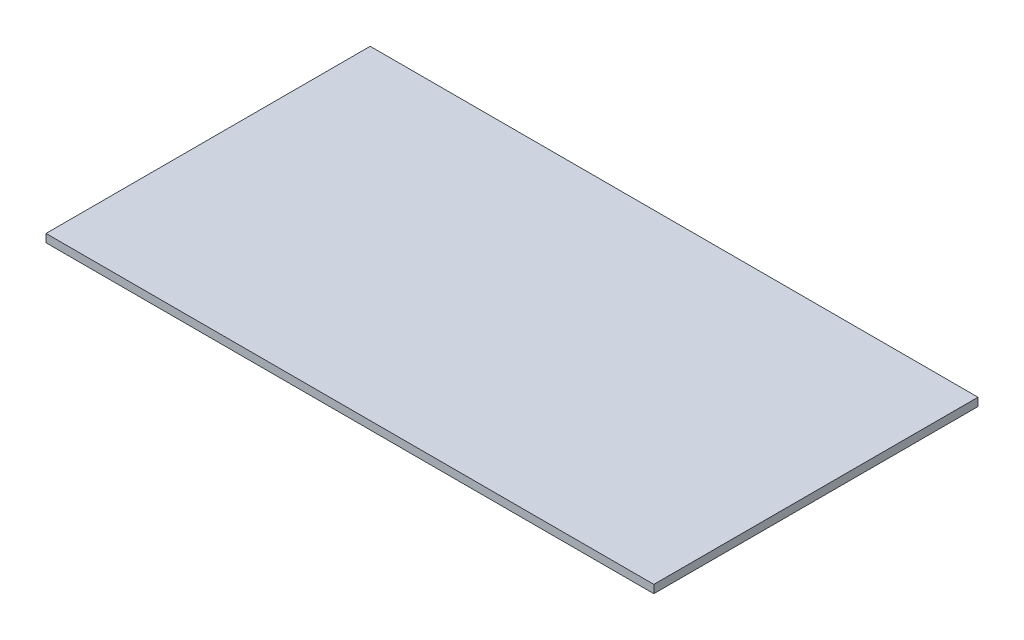
ISO-10303-21;
HEADER;
FILE_DESCRIPTION(('STEP AP214'),'2;1');
FILE_NAME('part.step','',(''),(''),'','','');
FILE_SCHEMA(('AUTOMOTIVE_DESIGN { 1 0 10303 214 1 1 1 1 }'));
ENDSEC;
DATA;
#1=APPLICATION_CONTEXT('core data for automotive mechanical design processes');
#2=APPLICATION_PROTOCOL_DEFINITION('international standard','automotive_design',2000,#1);
#3=PRODUCT_CONTEXT('',#1,'mechanical');
#4=PRODUCT('Part','Part','',(#3));
#5=PRODUCT_RELATED_PRODUCT_CATEGORY('part','',(#4));
#6=PRODUCT_DEFINITION_FORMATION('','',#4);
#7=PRODUCT_DEFINITION_CONTEXT('part definition',#1,'design');
#8=PRODUCT_DEFINITION('design','',#6,#7);
#9=PRODUCT_DEFINITION_SHAPE('','',#8);
#10=(LENGTH_UNIT() NAMED_UNIT(*) SI_UNIT(.MILLI.,.METRE.));
#11=(NAMED_UNIT(*) PLANE_ANGLE_UNIT() SI_UNIT($,.RADIAN.));
#12=(NAMED_UNIT(*) SI_UNIT($,.STERADIAN.) SOLID_ANGLE_UNIT());
#13=UNCERTAINTY_MEASURE_WITH_UNIT(LENGTH_MEASURE(1.E-05),#10,'distance_accuracy_value','');
#14=(GEOMETRIC_REPRESENTATION_CONTEXT(3) GLOBAL_UNCERTAINTY_ASSIGNED_CONTEXT((#13)) GLOBAL_UNIT_ASSIGNED_CONTEXT((#10,
#11,#12)) REPRESENTATION_CONTEXT('',''));
#15=CARTESIAN_POINT('',(0.,0.,0.));
#16=DIRECTION('',(0.,0.,1.));
#17=DIRECTION('',(1.,0.,0.));
#18=AXIS2_PLACEMENT_3D('',#15,#16,#17);
#19=CARTESIAN_POINT('',(-750.,20.,400.));
#20=DIRECTION('',(1.,0.,0.));
#21=DIRECTION('',(0.,0.,-1.));
#22=AXIS2_PLACEMENT_3D('',#19,#20,#21);
#23=PLANE('',#22);
#24=DIRECTION('',(0.,0.,1.));
#25=VECTOR('',#24,1.);
#26=CARTESIAN_POINT('',(-750.,0.,400.));
#27=LINE('',#26,#25);
#28=CARTESIAN_POINT('',(-750.,0.,-400.));
#29=VERTEX_POINT('',#28);
#30=CARTESIAN_POINT('',(-750.,0.,400.));
#31=VERTEX_POINT('',#30);
#32=EDGE_CURVE('E100',#29,#31,#27,.T.);
#33=ORIENTED_EDGE('',*,*,#32,.T.);
#34=DIRECTION('',(0.,-1.,0.));
#35=VECTOR('',#34,1.);
#36=CARTESIAN_POINT('',(-750.,20.,400.));
#37=LINE('',#36,#35);
#38=CARTESIAN_POINT('',(-750.,20.,400.));
#39=VERTEX_POINT('',#38);
#40=EDGE_CURVE('E11',#39,#31,#37,.T.);
#41=ORIENTED_EDGE('',*,*,#40,.F.);
#42=DIRECTION('',(0.,0.,1.));
#43=VECTOR('',#42,1.);
#44=CARTESIAN_POINT('',(-750.,20.,400.));
#45=LINE('',#44,#43);
#46=CARTESIAN_POINT('',(-750.,20.,-400.));
#47=VERTEX_POINT('',#46);
#48=EDGE_CURVE('E88',#47,#39,#45,.T.);
#49=ORIENTED_EDGE('',*,*,#48,.F.);
#50=DIRECTION('',(0.,-1.,0.));
#51=VECTOR('',#50,1.);
#52=CARTESIAN_POINT('',(-750.,20.,-400.));
#53=LINE('',#52,#51);
#54=EDGE_CURVE('E96',#47,#29,#53,.T.);
#55=ORIENTED_EDGE('',*,*,#54,.T.);
#56=EDGE_LOOP('',(#33,#41,#49,#55));
#57=FACE_BOUND('',#56,.T.);
#58=ADVANCED_FACE('F37',(#57),#23,.F.);
#59=CARTESIAN_POINT('',(750.,20.,400.));
#60=DIRECTION('',(0.,0.,-1.));
#61=DIRECTION('',(-1.,0.,0.));
#62=AXIS2_PLACEMENT_3D('',#59,#60,#61);
#63=PLANE('',#62);
#64=DIRECTION('',(1.,0.,0.));
#65=VECTOR('',#64,1.);
#66=CARTESIAN_POINT('',(750.,0.,400.));
#67=LINE('',#66,#65);
#68=CARTESIAN_POINT('',(750.,0.,400.));
#69=VERTEX_POINT('',#68);
#70=EDGE_CURVE('E92',#31,#69,#67,.T.);
#71=ORIENTED_EDGE('',*,*,#70,.T.);
#72=DIRECTION('',(0.,-1.,0.));
#73=VECTOR('',#72,1.);
#74=CARTESIAN_POINT('',(750.,20.,400.));
#75=LINE('',#74,#73);
#76=CARTESIAN_POINT('',(750.,20.,400.));
#77=VERTEX_POINT('',#76);
#78=EDGE_CURVE('E45',#77,#69,#75,.T.);
#79=ORIENTED_EDGE('',*,*,#78,.F.);
#80=DIRECTION('',(1.,0.,0.));
#81=VECTOR('',#80,1.);
#82=CARTESIAN_POINT('',(750.,20.,400.));
#83=LINE('',#82,#81);
#84=EDGE_CURVE('E83',#39,#77,#83,.T.);
#85=ORIENTED_EDGE('',*,*,#84,.F.);
#86=ORIENTED_EDGE('',*,*,#40,.T.);
#87=EDGE_LOOP('',(#71,#79,#85,#86));
#88=FACE_BOUND('',#87,.T.);
#89=ADVANCED_FACE('F91',(#88),#63,.F.);
#90=CARTESIAN_POINT('',(750.,20.,400.));
#91=DIRECTION('',(-1.,0.,0.));
#92=DIRECTION('',(0.,0.,1.));
#93=AXIS2_PLACEMENT_3D('',#90,#91,#92);
#94=PLANE('',#93);
#95=DIRECTION('',(0.,0.,-1.));
#96=VECTOR('',#95,1.);
#97=CARTESIAN_POINT('',(750.,0.,400.));
#98=LINE('',#97,#96);
#99=CARTESIAN_POINT('',(750.,0.,-400.));
#100=VERTEX_POINT('',#99);
#101=EDGE_CURVE('E70',#69,#100,#98,.T.);
#102=ORIENTED_EDGE('',*,*,#101,.T.);
#103=DIRECTION('',(0.,-1.,0.));
#104=VECTOR('',#103,1.);
#105=CARTESIAN_POINT('',(750.,20.,-400.));
#106=LINE('',#105,#104);
#107=CARTESIAN_POINT('',(750.,20.,-400.));
#108=VERTEX_POINT('',#107);
#109=EDGE_CURVE('E93',#108,#100,#106,.T.);
#110=ORIENTED_EDGE('',*,*,#109,.F.);
#111=DIRECTION('',(0.,0.,-1.));
#112=VECTOR('',#111,1.);
#113=CARTESIAN_POINT('',(750.,20.,400.));
#114=LINE('',#113,#112);
#115=EDGE_CURVE('E86',#77,#108,#114,.T.);
#116=ORIENTED_EDGE('',*,*,#115,.F.);
#117=ORIENTED_EDGE('',*,*,#78,.T.);
#118=EDGE_LOOP('',(#102,#110,#116,#117));
#119=FACE_BOUND('',#118,.T.);
#120=ADVANCED_FACE('F94',(#119),#94,.F.);
#121=CARTESIAN_POINT('',(750.,20.,-400.));
#122=DIRECTION('',(0.,0.,1.));
#123=DIRECTION('',(1.,0.,0.));
#124=AXIS2_PLACEMENT_3D('',#121,#122,#123);
#125=PLANE('',#124);
#126=DIRECTION('',(-1.,0.,0.));
#127=VECTOR('',#126,1.);
#128=CARTESIAN_POINT('',(750.,0.,-400.));
#129=LINE('',#128,#127);
#130=EDGE_CURVE('E76',#100,#29,#129,.T.);
#131=ORIENTED_EDGE('',*,*,#130,.T.);
#132=ORIENTED_EDGE('',*,*,#54,.F.);
#133=DIRECTION('',(-1.,0.,0.));
#134=VECTOR('',#133,1.);
#135=CARTESIAN_POINT('',(750.,20.,-400.));
#136=LINE('',#135,#134);
#137=EDGE_CURVE('E53',#108,#47,#136,.T.);
#138=ORIENTED_EDGE('',*,*,#137,.F.);
#139=ORIENTED_EDGE('',*,*,#109,.T.);
#140=EDGE_LOOP('',(#131,#132,#138,#139));
#141=FACE_BOUND('',#140,.T.);
#142=ADVANCED_FACE('F107',(#141),#125,.F.);
#143=CARTESIAN_POINT('',(0.,20.,0.));
#144=DIRECTION('',(0.,1.,0.));
#145=DIRECTION('',(0.,0.,1.));
#146=AXIS2_PLACEMENT_3D('',#143,#144,#145);
#147=PLANE('',#146);
#148=ORIENTED_EDGE('',*,*,#48,.T.);
#149=ORIENTED_EDGE('',*,*,#84,.T.);
#150=ORIENTED_EDGE('',*,*,#115,.T.);
#151=ORIENTED_EDGE('',*,*,#137,.T.);
#152=EDGE_LOOP('',(#148,#149,#150,#151));
#153=FACE_BOUND('',#152,.T.);
#154=ADVANCED_FACE('F84',(#153),#147,.T.);
#155=CARTESIAN_POINT('',(0.,0.,0.));
#156=DIRECTION('',(0.,1.,0.));
#157=DIRECTION('',(0.,0.,1.));
#158=AXIS2_PLACEMENT_3D('',#155,#156,#157);
#159=PLANE('',#158);
#160=ORIENTED_EDGE('',*,*,#32,.F.);
#161=ORIENTED_EDGE('',*,*,#130,.F.);
#162=ORIENTED_EDGE('',*,*,#101,.F.);
#163=ORIENTED_EDGE('',*,*,#70,.F.);
#164=EDGE_LOOP('',(#160,#161,#162,#163));
#165=FACE_BOUND('',#164,.T.);
#166=ADVANCED_FACE('F110',(#165),#159,.F.);
#167=CLOSED_SHELL('',(#58,#89,#120,#142,#154,#166));
#168=MANIFOLD_SOLID_BREP('B2',#167);
#169=ADVANCED_BREP_SHAPE_REPRESENTATION('',(#18,#168),#14);
#170=SHAPE_DEFINITION_REPRESENTATION(#9,#169);
ENDSEC;
END-ISO-10303-21;
